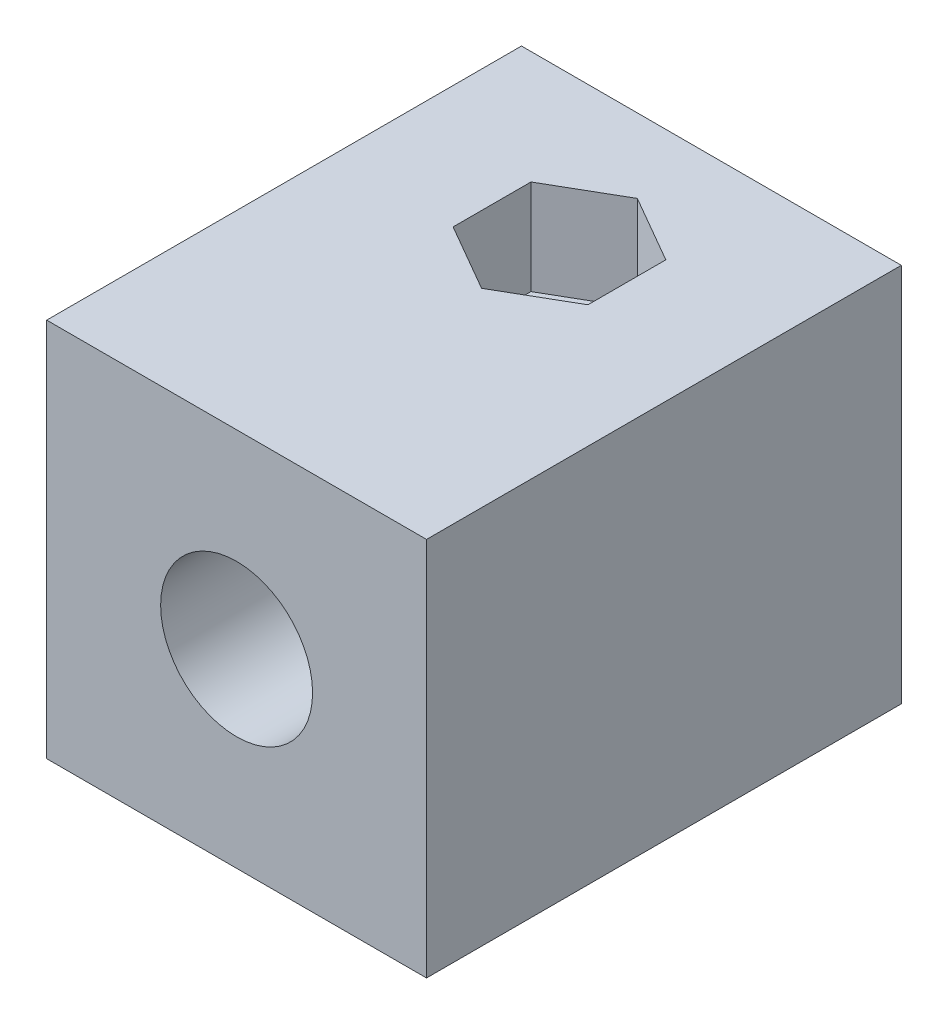
ISO-10303-21;
HEADER;
FILE_DESCRIPTION(('STEP AP214'),'2;1');
FILE_NAME('part.step','',(''),(''),'','','');
FILE_SCHEMA(('AUTOMOTIVE_DESIGN { 1 0 10303 214 1 1 1 1 }'));
ENDSEC;
DATA;
#1=APPLICATION_CONTEXT('core data for automotive mechanical design processes');
#2=APPLICATION_PROTOCOL_DEFINITION('international standard','automotive_design',2000,#1);
#3=PRODUCT_CONTEXT('',#1,'mechanical');
#4=PRODUCT('Part','Part','',(#3));
#5=PRODUCT_RELATED_PRODUCT_CATEGORY('part','',(#4));
#6=PRODUCT_DEFINITION_FORMATION('','',#4);
#7=PRODUCT_DEFINITION_CONTEXT('part definition',#1,'design');
#8=PRODUCT_DEFINITION('design','',#6,#7);
#9=PRODUCT_DEFINITION_SHAPE('','',#8);
#10=(LENGTH_UNIT() NAMED_UNIT(*) SI_UNIT(.MILLI.,.METRE.));
#11=(NAMED_UNIT(*) PLANE_ANGLE_UNIT() SI_UNIT($,.RADIAN.));
#12=(NAMED_UNIT(*) SI_UNIT($,.STERADIAN.) SOLID_ANGLE_UNIT());
#13=UNCERTAINTY_MEASURE_WITH_UNIT(LENGTH_MEASURE(1.E-05),#10,'distance_accuracy_value','');
#14=(GEOMETRIC_REPRESENTATION_CONTEXT(3) GLOBAL_UNCERTAINTY_ASSIGNED_CONTEXT((#13)) GLOBAL_UNIT_ASSIGNED_CONTEXT((#10,
#11,#12)) REPRESENTATION_CONTEXT('',''));
#15=CARTESIAN_POINT('',(0.,0.,0.));
#16=DIRECTION('',(0.,0.,1.));
#17=DIRECTION('',(1.,0.,0.));
#18=AXIS2_PLACEMENT_3D('',#15,#16,#17);
#19=CARTESIAN_POINT('',(0.,0.,-4.5));
#20=DIRECTION('',(0.,1.,0.));
#21=DIRECTION('',(0.,0.,1.));
#22=AXIS2_PLACEMENT_3D('',#19,#20,#21);
#23=CYLINDRICAL_SURFACE('',#22,1.5);
#24=CARTESIAN_POINT('',(0.,14.,-3.));
#25=CARTESIAN_POINT('',(0.0812350589378528,14.0000021745615,-2.99999709769689));
#26=CARTESIAN_POINT('',(0.162450241781792,13.9975037928318,-3.00661976024838));
#27=CARTESIAN_POINT('',(0.322453452352361,13.9877869600693,-3.03282819526993));
#28=CARTESIAN_POINT('',(0.401241827987616,13.9805691889399,-3.05241210047057));
#29=CARTESIAN_POINT('',(0.554060784990879,13.9621883239154,-3.10375300177176));
#30=CARTESIAN_POINT('',(0.628100224162277,13.9510328434944,-3.13548651682179));
#31=CARTESIAN_POINT('',(0.769799310160253,13.9258876776535,-3.21010641301582));
#32=CARTESIAN_POINT('',(0.837457239177879,13.9118972322755,-3.25299578554416));
#33=CARTESIAN_POINT('',(0.967346417045826,13.8818624697122,-3.35061253107091));
#34=CARTESIAN_POINT('',(1.02927073015119,13.8657600258357,-3.4057302622594));
#35=CARTESIAN_POINT('',(1.14324421474363,13.8336022087133,-3.52541043465884));
#36=CARTESIAN_POINT('',(1.19529036359203,13.8175468513503,-3.58997575608788));
#37=CARTESIAN_POINT('',(1.28998202215985,13.7866247061773,-3.72971746752321));
#38=CARTESIAN_POINT('',(1.3321939319576,13.7718264882082,-3.80520436654582));
#39=CARTESIAN_POINT('',(1.40318646334084,13.7459986023743,-3.96284835416852));
#40=CARTESIAN_POINT('',(1.43197244961239,13.7349674297588,-4.0450027631551));
#41=CARTESIAN_POINT('',(1.47408431017549,13.7185441282414,-4.2101167402582));
#42=CARTESIAN_POINT('',(1.48799593218558,13.7129392435084,-4.29290503843544));
#43=CARTESIAN_POINT('',(1.50179556531648,13.7073806146121,-4.45981615799384));
#44=CARTESIAN_POINT('',(1.5016893680263,13.707424536593,-4.54393841387447));
#45=CARTESIAN_POINT('',(1.48790429610018,13.7129751163205,-4.70576952521296));
#46=CARTESIAN_POINT('',(1.47503808509003,13.7181546887112,-4.78356090604418));
#47=CARTESIAN_POINT('',(1.4374416786833,13.7328493805953,-4.93578715040532));
#48=CARTESIAN_POINT('',(1.41270969663258,13.7423651529886,-5.01022150661388));
#49=CARTESIAN_POINT('',(1.35163748571904,13.7648570219025,-5.15527706772823));
#50=CARTESIAN_POINT('',(1.31508648737101,13.7778951798817,-5.2257994861213));
#51=CARTESIAN_POINT('',(1.23156073762698,13.8059421013932,-5.35994573759097));
#52=CARTESIAN_POINT('',(1.18458238728897,13.8209515445716,-5.4235671775197));
#53=CARTESIAN_POINT('',(1.07781780766549,13.8524803885911,-5.54660366365088));
#54=CARTESIAN_POINT('',(1.01738298716955,13.8690334745567,-5.60544864074809));
#55=CARTESIAN_POINT('',(0.88731259081902,13.9009172816409,-5.7123379662058));
#56=CARTESIAN_POINT('',(0.817675603497363,13.9162478146595,-5.76038065460567));
#57=CARTESIAN_POINT('',(0.669723436992419,13.9442639480908,-5.84493039706252));
#58=CARTESIAN_POINT('',(0.591290713844718,13.9569049825962,-5.88124758122106));
#59=CARTESIAN_POINT('',(0.428836850524582,13.9777871832696,-5.93998260427004));
#60=CARTESIAN_POINT('',(0.344818210845767,13.9860303034149,-5.96240661656112));
#61=CARTESIAN_POINT('',(0.178375243148664,13.9968444322807,-5.99162278754194));
#62=CARTESIAN_POINT('',(0.0961036195622086,13.9996936902569,-5.99918260638251));
#63=CARTESIAN_POINT('',(-0.0685724752550247,14.0002589370013,-6.00069106389992));
#64=CARTESIAN_POINT('',(-0.150976912983373,13.9979760638686,-5.99464272031678));
#65=CARTESIAN_POINT('',(-0.310262048561859,13.9887170977264,-5.96968995769133));
#66=CARTESIAN_POINT('',(-0.387233328007336,13.981924709623,-5.95128845626292));
#67=CARTESIAN_POINT('',(-0.536941754957221,13.9645147709172,-5.90281392745268));
#68=CARTESIAN_POINT('',(-0.609678350347535,13.9538967228203,-5.87273938205196));
#69=CARTESIAN_POINT('',(-0.751247765110156,13.9294962440768,-5.80081358756052));
#70=CARTESIAN_POINT('',(-0.819903083557796,13.9156300020935,-5.75864227077661));
#71=CARTESIAN_POINT('',(-0.949392711726626,13.8862667156466,-5.66408189682844));
#72=CARTESIAN_POINT('',(-1.01022412027045,13.8707690700952,-5.61168906745485));
#73=CARTESIAN_POINT('',(-1.12603079874454,13.8387332949099,-5.49459587787573));
#74=CARTESIAN_POINT('',(-1.18046154123568,13.8221869650373,-5.4293578172273));
#75=CARTESIAN_POINT('',(-1.27771050031903,13.7907881574685,-5.29034861529234));
#76=CARTESIAN_POINT('',(-1.32052767414518,13.775935831944,-5.2165767086115));
#77=CARTESIAN_POINT('',(-1.39337773518998,13.7496682982246,-5.06198401322769));
#78=CARTESIAN_POINT('',(-1.42335685446918,13.7382676032849,-4.98113525408956));
#79=CARTESIAN_POINT('',(-1.46907883466889,13.7205403289101,-4.81499023631218));
#80=CARTESIAN_POINT('',(-1.48483050305535,13.7142106105749,-4.72969676380188));
#81=CARTESIAN_POINT('',(-1.50086347097839,13.7077589479257,-4.56298384045889));
#82=CARTESIAN_POINT('',(-1.50207331495837,13.7072644452334,-4.48166736828312));
#83=CARTESIAN_POINT('',(-1.49136715641593,13.7115841274529,-4.32005468372384));
#84=CARTESIAN_POINT('',(-1.47945239850124,13.716397808989,-4.23975837532842));
#85=CARTESIAN_POINT('',(-1.44355815630242,13.7304814158543,-4.08495277328345));
#86=CARTESIAN_POINT('',(-1.41995798316524,13.7396108537666,-4.01034165375466));
#87=CARTESIAN_POINT('',(-1.3616969677992,13.7612154829784,-3.86609449150558));
#88=CARTESIAN_POINT('',(-1.32703332944945,13.7736915199521,-3.79645971192986));
#89=CARTESIAN_POINT('',(-1.24552075938154,13.8013972390396,-3.66017321030237));
#90=CARTESIAN_POINT('',(-1.1981283280301,13.8167369844096,-3.59386920320009));
#91=CARTESIAN_POINT('',(-1.09334485729906,13.8480624675718,-3.4698584390288));
#92=CARTESIAN_POINT('',(-1.03595064012808,13.8640484094314,-3.41215442521325));
#93=CARTESIAN_POINT('',(-0.909080396784623,13.8959042460988,-3.30379804417816));
#94=CARTESIAN_POINT('',(-0.839118644212992,13.9117210490064,-3.25369624656533));
#95=CARTESIAN_POINT('',(-0.691213223200821,13.9405451445703,-3.16597734472344));
#96=CARTESIAN_POINT('',(-0.613268934090621,13.9535522185156,-3.12836121226363));
#97=CARTESIAN_POINT('',(-0.447999082002312,13.9757429260668,-3.06562317095167));
#98=CARTESIAN_POINT('',(-0.360413422234208,13.9847365715836,-3.0411129353981));
#99=CARTESIAN_POINT('',(-0.181875733606382,13.9968624217959,-3.00830704007932));
#100=CARTESIAN_POINT('',(-0.0909254163648589,13.9999975660397,-3.00000324851268));
#101=CARTESIAN_POINT('',(0.,14.,-3.));
#102=B_SPLINE_CURVE_WITH_KNOTS('',3,(#24,#25,#26,#27,#28,#29,#30,#31,#32,#33,#34,#35,#36,#37,
#38,#39,#40,#41,#42,#43,#44,#45,#46,#47,#48,#49,#50,#51,#52,#53,#54,#55,#56,#57,#58,#59,#60,#61,
#62,#63,#64,#65,#66,#67,#68,#69,#70,#71,#72,#73,#74,#75,#76,#77,#78,#79,#80,#81,#82,#83,#84,#85,
#86,#87,#88,#89,#90,#91,#92,#93,#94,#95,#96,#97,#98,#99,#100,#101),.UNSPECIFIED.,.T.,.F.,(4,2,2,
2,2,2,2,2,2,2,2,2,2,2,2,2,2,2,2,2,2,2,2,2,2,2,2,2,2,2,2,2,2,2,2,2,2,2,4),(0.,0.24336980156056,
0.486704549530461,0.729571369213573,0.97250337960949,1.22473618582715,1.47704604925622,
1.73896674501659,2.00078269352134,2.25185874416902,2.50283106079707,2.73878345119971,
2.97477138060589,3.21522408387018,3.45575990744259,3.71246153335813,3.96920257905066,
4.22991375286075,4.49050899698846,4.73725019635926,4.98393668390521,5.2211443792384,
5.45838293254454,5.702592218596,5.94689180019868,6.20536519455658,6.46386178920141,
6.72343066727204,6.98283874956507,7.22558763480252,7.46831350211259,7.70363142426533,
7.93900886656507,8.18672471884271,8.43451941997062,8.69572329654039,8.95694749805102,
9.22948515032042,9.50188601796128),.UNSPECIFIED.);
#103=CARTESIAN_POINT('',(0.,14.,-3.));
#104=VERTEX_POINT('',#103);
#105=EDGE_CURVE('E181',#104,#104,#102,.T.);
#106=ORIENTED_EDGE('',*,*,#105,.F.);
#107=EDGE_LOOP('',(#106));
#108=FACE_BOUND('',#107,.T.);
#109=CARTESIAN_POINT('',(0.,15.,-4.5));
#110=DIRECTION('',(0.,1.,0.));
#111=DIRECTION('',(0.,0.,1.));
#112=AXIS2_PLACEMENT_3D('',#109,#110,#111);
#113=CIRCLE('',#112,1.5);
#114=CARTESIAN_POINT('',(0.,15.,-3.));
#115=VERTEX_POINT('',#114);
#116=EDGE_CURVE('E39',#115,#115,#113,.F.);
#117=ORIENTED_EDGE('',*,*,#116,.F.);
#118=EDGE_LOOP('',(#117));
#119=FACE_BOUND('',#118,.T.);
#120=ADVANCED_FACE('F35',(#108,#119),#23,.F.);
#121=CARTESIAN_POINT('',(-10.,20.,12.5));
#122=DIRECTION('',(1.,0.,0.));
#123=DIRECTION('',(0.,0.,-1.));
#124=AXIS2_PLACEMENT_3D('',#121,#122,#123);
#125=PLANE('',#124);
#126=DIRECTION('',(0.,0.,1.));
#127=VECTOR('',#126,1.);
#128=CARTESIAN_POINT('',(-10.,0.,12.5));
#129=LINE('',#128,#127);
#130=CARTESIAN_POINT('',(-10.,0.,-12.5));
#131=VERTEX_POINT('',#130);
#132=CARTESIAN_POINT('',(-10.,0.,12.5));
#133=VERTEX_POINT('',#132);
#134=EDGE_CURVE('E185',#131,#133,#129,.T.);
#135=ORIENTED_EDGE('',*,*,#134,.T.);
#136=DIRECTION('',(0.,-1.,0.));
#137=VECTOR('',#136,1.);
#138=CARTESIAN_POINT('',(-10.,20.,12.5));
#139=LINE('',#138,#137);
#140=CARTESIAN_POINT('',(-10.,20.,12.5));
#141=VERTEX_POINT('',#140);
#142=EDGE_CURVE('E11',#141,#133,#139,.T.);
#143=ORIENTED_EDGE('',*,*,#142,.F.);
#144=DIRECTION('',(0.,0.,1.));
#145=VECTOR('',#144,1.);
#146=CARTESIAN_POINT('',(-10.,20.,12.5));
#147=LINE('',#146,#145);
#148=CARTESIAN_POINT('',(-10.,20.,-12.5));
#149=VERTEX_POINT('',#148);
#150=EDGE_CURVE('E190',#149,#141,#147,.T.);
#151=ORIENTED_EDGE('',*,*,#150,.F.);
#152=DIRECTION('',(0.,-1.,0.));
#153=VECTOR('',#152,1.);
#154=CARTESIAN_POINT('',(-10.,20.,-12.5));
#155=LINE('',#154,#153);
#156=EDGE_CURVE('E196',#149,#131,#155,.T.);
#157=ORIENTED_EDGE('',*,*,#156,.T.);
#158=EDGE_LOOP('',(#135,#143,#151,#157));
#159=FACE_BOUND('',#158,.T.);
#160=ADVANCED_FACE('F37',(#159),#125,.F.);
#161=CARTESIAN_POINT('',(10.,20.,12.5));
#162=DIRECTION('',(0.,0.,-1.));
#163=DIRECTION('',(-1.,0.,0.));
#164=AXIS2_PLACEMENT_3D('',#161,#162,#163);
#165=PLANE('',#164);
#166=CARTESIAN_POINT('',(0.,10.,12.5));
#167=DIRECTION('',(0.,0.,1.));
#168=DIRECTION('',(1.,0.,0.));
#169=AXIS2_PLACEMENT_3D('',#166,#167,#168);
#170=CIRCLE('',#169,4.);
#171=CARTESIAN_POINT('',(4.,10.,12.5));
#172=VERTEX_POINT('',#171);
#173=EDGE_CURVE('E186',#172,#172,#170,.T.);
#174=ORIENTED_EDGE('',*,*,#173,.F.);
#175=EDGE_LOOP('',(#174));
#176=FACE_BOUND('',#175,.T.);
#177=DIRECTION('',(1.,0.,0.));
#178=VECTOR('',#177,1.);
#179=CARTESIAN_POINT('',(10.,0.,12.5));
#180=LINE('',#179,#178);
#181=CARTESIAN_POINT('',(10.,0.,12.5));
#182=VERTEX_POINT('',#181);
#183=EDGE_CURVE('E199',#133,#182,#180,.T.);
#184=ORIENTED_EDGE('',*,*,#183,.T.);
#185=DIRECTION('',(0.,-1.,0.));
#186=VECTOR('',#185,1.);
#187=CARTESIAN_POINT('',(10.,20.,12.5));
#188=LINE('',#187,#186);
#189=CARTESIAN_POINT('',(10.,20.,12.5));
#190=VERTEX_POINT('',#189);
#191=EDGE_CURVE('E44',#190,#182,#188,.T.);
#192=ORIENTED_EDGE('',*,*,#191,.F.);
#193=DIRECTION('',(1.,0.,0.));
#194=VECTOR('',#193,1.);
#195=CARTESIAN_POINT('',(10.,20.,12.5));
#196=LINE('',#195,#194);
#197=EDGE_CURVE('E89',#141,#190,#196,.T.);
#198=ORIENTED_EDGE('',*,*,#197,.F.);
#199=ORIENTED_EDGE('',*,*,#142,.T.);
#200=EDGE_LOOP('',(#184,#192,#198,#199));
#201=FACE_BOUND('',#200,.T.);
#202=ADVANCED_FACE('F242',(#176,#201),#165,.F.);
#203=CARTESIAN_POINT('',(10.,20.,12.5));
#204=DIRECTION('',(-1.,0.,0.));
#205=DIRECTION('',(0.,0.,1.));
#206=AXIS2_PLACEMENT_3D('',#203,#204,#205);
#207=PLANE('',#206);
#208=DIRECTION('',(0.,0.,-1.));
#209=VECTOR('',#208,1.);
#210=CARTESIAN_POINT('',(10.,0.,12.5));
#211=LINE('',#210,#209);
#212=CARTESIAN_POINT('',(10.,0.,-12.5));
#213=VERTEX_POINT('',#212);
#214=EDGE_CURVE('E201',#182,#213,#211,.T.);
#215=ORIENTED_EDGE('',*,*,#214,.T.);
#216=DIRECTION('',(0.,-1.,0.));
#217=VECTOR('',#216,1.);
#218=CARTESIAN_POINT('',(10.,20.,-12.5));
#219=LINE('',#218,#217);
#220=CARTESIAN_POINT('',(10.,20.,-12.5));
#221=VERTEX_POINT('',#220);
#222=EDGE_CURVE('E205',#221,#213,#219,.T.);
#223=ORIENTED_EDGE('',*,*,#222,.F.);
#224=DIRECTION('',(0.,0.,-1.));
#225=VECTOR('',#224,1.);
#226=CARTESIAN_POINT('',(10.,20.,12.5));
#227=LINE('',#226,#225);
#228=EDGE_CURVE('E193',#190,#221,#227,.T.);
#229=ORIENTED_EDGE('',*,*,#228,.F.);
#230=ORIENTED_EDGE('',*,*,#191,.T.);
#231=EDGE_LOOP('',(#215,#223,#229,#230));
#232=FACE_BOUND('',#231,.T.);
#233=ADVANCED_FACE('F344',(#232),#207,.F.);
#234=CARTESIAN_POINT('',(10.,20.,-12.5));
#235=DIRECTION('',(0.,0.,1.));
#236=DIRECTION('',(1.,0.,0.));
#237=AXIS2_PLACEMENT_3D('',#234,#235,#236);
#238=PLANE('',#237);
#239=DIRECTION('',(-1.,0.,0.));
#240=VECTOR('',#239,1.);
#241=CARTESIAN_POINT('',(10.,0.,-12.5));
#242=LINE('',#241,#240);
#243=EDGE_CURVE('E82',#213,#131,#242,.T.);
#244=ORIENTED_EDGE('',*,*,#243,.T.);
#245=ORIENTED_EDGE('',*,*,#156,.F.);
#246=DIRECTION('',(-1.,0.,0.));
#247=VECTOR('',#246,1.);
#248=CARTESIAN_POINT('',(10.,20.,-12.5));
#249=LINE('',#248,#247);
#250=EDGE_CURVE('E61',#221,#149,#249,.T.);
#251=ORIENTED_EDGE('',*,*,#250,.F.);
#252=ORIENTED_EDGE('',*,*,#222,.T.);
#253=EDGE_LOOP('',(#244,#245,#251,#252));
#254=FACE_BOUND('',#253,.T.);
#255=ADVANCED_FACE('F304',(#254),#238,.F.);
#256=CARTESIAN_POINT('',(0.,20.,0.));
#257=DIRECTION('',(0.,1.,0.));
#258=DIRECTION('',(0.,0.,1.));
#259=AXIS2_PLACEMENT_3D('',#256,#257,#258);
#260=PLANE('',#259);
#261=DIRECTION('',(-0.866025403784438,0.,-0.5));
#262=VECTOR('',#261,1.);
#263=CARTESIAN_POINT('',(3.5507041555162,20.,-6.55));
#264=LINE('',#263,#262);
#265=CARTESIAN_POINT('',(3.5507041555162,20.,-6.55));
#266=VERTEX_POINT('',#265);
#267=CARTESIAN_POINT('',(0.,20.,-8.6));
#268=VERTEX_POINT('',#267);
#269=EDGE_CURVE('E52',#266,#268,#264,.T.);
#270=ORIENTED_EDGE('',*,*,#269,.F.);
#271=DIRECTION('',(0.,0.,-1.));
#272=VECTOR('',#271,1.);
#273=CARTESIAN_POINT('',(3.55070415551621,20.,-2.45));
#274=LINE('',#273,#272);
#275=CARTESIAN_POINT('',(3.55070415551621,20.,-2.45));
#276=VERTEX_POINT('',#275);
#277=EDGE_CURVE('E145',#276,#266,#274,.T.);
#278=ORIENTED_EDGE('',*,*,#277,.F.);
#279=DIRECTION('',(0.866025403784439,0.,-0.5));
#280=VECTOR('',#279,1.);
#281=CARTESIAN_POINT('',(0.,20.,-0.399999999999992));
#282=LINE('',#281,#280);
#283=CARTESIAN_POINT('',(0.,20.,-0.399999999999992));
#284=VERTEX_POINT('',#283);
#285=EDGE_CURVE('E148',#284,#276,#282,.T.);
#286=ORIENTED_EDGE('',*,*,#285,.F.);
#287=DIRECTION('',(0.866025403784439,0.,0.5));
#288=VECTOR('',#287,1.);
#289=CARTESIAN_POINT('',(-3.55070415551621,20.,-2.45));
#290=LINE('',#289,#288);
#291=CARTESIAN_POINT('',(-3.55070415551621,20.,-2.45));
#292=VERTEX_POINT('',#291);
#293=EDGE_CURVE('E164',#292,#284,#290,.T.);
#294=ORIENTED_EDGE('',*,*,#293,.F.);
#295=DIRECTION('',(0.,0.,1.));
#296=VECTOR('',#295,1.);
#297=CARTESIAN_POINT('',(-3.55070415551621,20.,-6.55000000000001));
#298=LINE('',#297,#296);
#299=CARTESIAN_POINT('',(-3.55070415551621,20.,-6.55000000000001));
#300=VERTEX_POINT('',#299);
#301=EDGE_CURVE('E161',#300,#292,#298,.T.);
#302=ORIENTED_EDGE('',*,*,#301,.F.);
#303=DIRECTION('',(-0.86602540378444,0.,0.499999999999998));
#304=VECTOR('',#303,1.);
#305=CARTESIAN_POINT('',(0.,20.,-8.6));
#306=LINE('',#305,#304);
#307=EDGE_CURVE('E159',#268,#300,#306,.T.);
#308=ORIENTED_EDGE('',*,*,#307,.F.);
#309=EDGE_LOOP('',(#270,#278,#286,#294,#302,#308));
#310=FACE_BOUND('',#309,.T.);
#311=ORIENTED_EDGE('',*,*,#150,.T.);
#312=ORIENTED_EDGE('',*,*,#197,.T.);
#313=ORIENTED_EDGE('',*,*,#228,.T.);
#314=ORIENTED_EDGE('',*,*,#250,.T.);
#315=EDGE_LOOP('',(#311,#312,#313,#314));
#316=FACE_BOUND('',#315,.T.);
#317=ADVANCED_FACE('F301',(#310,#316),#260,.T.);
#318=CARTESIAN_POINT('',(0.,0.,0.));
#319=DIRECTION('',(0.,1.,0.));
#320=DIRECTION('',(0.,0.,1.));
#321=AXIS2_PLACEMENT_3D('',#318,#319,#320);
#322=PLANE('',#321);
#323=CARTESIAN_POINT('',(0.,0.,-4.5));
#324=DIRECTION('',(0.,1.,0.));
#325=DIRECTION('',(0.,0.,1.));
#326=AXIS2_PLACEMENT_3D('',#323,#324,#325);
#327=CIRCLE('',#326,1.5);
#328=CARTESIAN_POINT('',(0.,0.,-3.));
#329=VERTEX_POINT('',#328);
#330=EDGE_CURVE('E178',#329,#329,#327,.T.);
#331=ORIENTED_EDGE('',*,*,#330,.T.);
#332=EDGE_LOOP('',(#331));
#333=FACE_BOUND('',#332,.T.);
#334=ORIENTED_EDGE('',*,*,#134,.F.);
#335=ORIENTED_EDGE('',*,*,#243,.F.);
#336=ORIENTED_EDGE('',*,*,#214,.F.);
#337=ORIENTED_EDGE('',*,*,#183,.F.);
#338=EDGE_LOOP('',(#334,#335,#336,#337));
#339=FACE_BOUND('',#338,.T.);
#340=ADVANCED_FACE('F233',(#333,#339),#322,.F.);
#341=CARTESIAN_POINT('',(0.,10.,-7.5));
#342=DIRECTION('',(0.,0.,1.));
#343=DIRECTION('',(1.,0.,0.));
#344=AXIS2_PLACEMENT_3D('',#341,#342,#343);
#345=CYLINDRICAL_SURFACE('',#344,4.);
#346=CARTESIAN_POINT('',(0.,6.,-3.));
#347=CARTESIAN_POINT('',(-0.0812350589378528,5.99999782543849,-2.99999709769689));
#348=CARTESIAN_POINT('',(-0.162450241781792,6.00249620716816,-3.00661976024838));
#349=CARTESIAN_POINT('',(-0.322453452352361,6.01221303993072,-3.03282819526993));
#350=CARTESIAN_POINT('',(-0.401241827987616,6.01943081106007,-3.05241210047057));
#351=CARTESIAN_POINT('',(-0.554060784990879,6.03781167608455,-3.10375300177176));
#352=CARTESIAN_POINT('',(-0.628100224162277,6.0489671565056,-3.13548651682179));
#353=CARTESIAN_POINT('',(-0.769799310160254,6.07411232234647,-3.21010641301582));
#354=CARTESIAN_POINT('',(-0.837457239177879,6.08810276772452,-3.25299578554416));
#355=CARTESIAN_POINT('',(-0.967346417045825,6.11813753028783,-3.35061253107091));
#356=CARTESIAN_POINT('',(-1.02927073015119,6.13423997416434,-3.4057302622594));
#357=CARTESIAN_POINT('',(-1.14324421474363,6.16639779128673,-3.52541043465884));
#358=CARTESIAN_POINT('',(-1.19529036359203,6.18245314864967,-3.58997575608787));
#359=CARTESIAN_POINT('',(-1.28998202215985,6.21337529382269,-3.72971746752321));
#360=CARTESIAN_POINT('',(-1.3321939319576,6.22817351179182,-3.80520436654582));
#361=CARTESIAN_POINT('',(-1.40318646334084,6.25400139762567,-3.96284835416852));
#362=CARTESIAN_POINT('',(-1.43197244961239,6.26503257024119,-4.0450027631551));
#363=CARTESIAN_POINT('',(-1.47408431017549,6.28145587175864,-4.2101167402582));
#364=CARTESIAN_POINT('',(-1.48799593218558,6.28706075649162,-4.29290503843544));
#365=CARTESIAN_POINT('',(-1.50179556531648,6.29261938538785,-4.45981615799384));
#366=CARTESIAN_POINT('',(-1.50168936802631,6.29257546340695,-4.54393841387447));
#367=CARTESIAN_POINT('',(-1.48790429610018,6.28702488367945,-4.70576952521296));
#368=CARTESIAN_POINT('',(-1.47503808509003,6.28184531128878,-4.78356090604418));
#369=CARTESIAN_POINT('',(-1.4374416786833,6.26715061940471,-4.93578715040532));
#370=CARTESIAN_POINT('',(-1.41270969663258,6.25763484701137,-5.01022150661388));
#371=CARTESIAN_POINT('',(-1.35163748571904,6.23514297809747,-5.15527706772823));
#372=CARTESIAN_POINT('',(-1.31508648737101,6.22210482011834,-5.2257994861213));
#373=CARTESIAN_POINT('',(-1.23156073762698,6.19405789860681,-5.35994573759097));
#374=CARTESIAN_POINT('',(-1.18458238728897,6.17904845542842,-5.4235671775197));
#375=CARTESIAN_POINT('',(-1.07781780766549,6.14751961140887,-5.54660366365088));
#376=CARTESIAN_POINT('',(-1.01738298716955,6.13096652544329,-5.60544864074809));
#377=CARTESIAN_POINT('',(-0.887312590819021,6.09908271835915,-5.7123379662058));
#378=CARTESIAN_POINT('',(-0.817675603497364,6.08375218534048,-5.76038065460567));
#379=CARTESIAN_POINT('',(-0.66972343699242,6.0557360519092,-5.84493039706252));
#380=CARTESIAN_POINT('',(-0.591290713844719,6.04309501740384,-5.88124758122106));
#381=CARTESIAN_POINT('',(-0.428836850524584,6.02221281673038,-5.93998260427004));
#382=CARTESIAN_POINT('',(-0.344818210845768,6.01396969658507,-5.96240661656112));
#383=CARTESIAN_POINT('',(-0.178375243148666,6.00315556771935,-5.99162278754194));
#384=CARTESIAN_POINT('',(-0.0961036195622097,6.00030630974314,-5.99918260638251));
#385=CARTESIAN_POINT('',(0.0685724752550239,5.99974106299874,-6.00069106389992));
#386=CARTESIAN_POINT('',(0.150976912983373,6.00202393613137,-5.99464272031678));
#387=CARTESIAN_POINT('',(0.310262048561859,6.01128290227357,-5.96968995769133));
#388=CARTESIAN_POINT('',(0.387233328007335,6.01807529037695,-5.95128845626292));
#389=CARTESIAN_POINT('',(0.53694175495722,6.03548522908283,-5.90281392745268));
#390=CARTESIAN_POINT('',(0.609678350347534,6.0461032771797,-5.87273938205197));
#391=CARTESIAN_POINT('',(0.751247765110155,6.07050375592319,-5.80081358756053));
#392=CARTESIAN_POINT('',(0.819903083557795,6.08436999790652,-5.75864227077662));
#393=CARTESIAN_POINT('',(0.949392711726625,6.11373328435336,-5.66408189682844));
#394=CARTESIAN_POINT('',(1.01022412027045,6.12923092990484,-5.61168906745485));
#395=CARTESIAN_POINT('',(1.12603079874454,6.16126670509011,-5.49459587787573));
#396=CARTESIAN_POINT('',(1.18046154123568,6.17781303496271,-5.4293578172273));
#397=CARTESIAN_POINT('',(1.27771050031903,6.20921184253146,-5.29034861529234));
#398=CARTESIAN_POINT('',(1.32052767414518,6.22406416805601,-5.2165767086115));
#399=CARTESIAN_POINT('',(1.39337773518998,6.25033170177537,-5.06198401322769));
#400=CARTESIAN_POINT('',(1.42335685446918,6.26173239671507,-4.98113525408956));
#401=CARTESIAN_POINT('',(1.46907883466889,6.27945967108995,-4.81499023631218));
#402=CARTESIAN_POINT('',(1.48483050305535,6.28578938942509,-4.72969676380188));
#403=CARTESIAN_POINT('',(1.50086347097839,6.29224105207427,-4.56298384045889));
#404=CARTESIAN_POINT('',(1.50207331495837,6.29273555476659,-4.48166736828312));
#405=CARTESIAN_POINT('',(1.49136715641593,6.28841587254708,-4.32005468372384));
#406=CARTESIAN_POINT('',(1.47945239850124,6.28360219101101,-4.23975837532842));
#407=CARTESIAN_POINT('',(1.44355815630242,6.26951858414568,-4.08495277328345));
#408=CARTESIAN_POINT('',(1.41995798316524,6.26038914623337,-4.01034165375466));
#409=CARTESIAN_POINT('',(1.3616969677992,6.23878451702155,-3.86609449150558));
#410=CARTESIAN_POINT('',(1.32703332944945,6.22630848004785,-3.79645971192986));
#411=CARTESIAN_POINT('',(1.24552075938154,6.19860276096036,-3.66017321030237));
#412=CARTESIAN_POINT('',(1.1981283280301,6.18326301559036,-3.59386920320009));
#413=CARTESIAN_POINT('',(1.09334485729906,6.15193753242823,-3.4698584390288));
#414=CARTESIAN_POINT('',(1.03595064012808,6.13595159056855,-3.41215442521325));
#415=CARTESIAN_POINT('',(0.909080396784624,6.10409575390119,-3.30379804417816));
#416=CARTESIAN_POINT('',(0.839118644212993,6.08827895099355,-3.25369624656533));
#417=CARTESIAN_POINT('',(0.691213223200821,6.05945485542969,-3.16597734472344));
#418=CARTESIAN_POINT('',(0.613268934090622,6.04644778148441,-3.12836121226363));
#419=CARTESIAN_POINT('',(0.447999082002313,6.0242570739332,-3.06562317095167));
#420=CARTESIAN_POINT('',(0.360413422234209,6.01526342841644,-3.0411129353981));
#421=CARTESIAN_POINT('',(0.181875733606382,6.00313757820413,-3.00830704007932));
#422=CARTESIAN_POINT('',(0.0909254163648591,6.00000243396033,-3.00000324851268));
#423=CARTESIAN_POINT('',(0.,6.,-3.));
#424=B_SPLINE_CURVE_WITH_KNOTS('',3,(#346,#347,#348,#349,#350,#351,#352,#353,#354,#355,#356,
#357,#358,#359,#360,#361,#362,#363,#364,#365,#366,#367,#368,#369,#370,#371,#372,#373,#374,#375,
#376,#377,#378,#379,#380,#381,#382,#383,#384,#385,#386,#387,#388,#389,#390,#391,#392,#393,#394,
#395,#396,#397,#398,#399,#400,#401,#402,#403,#404,#405,#406,#407,#408,#409,#410,#411,#412,#413,
#414,#415,#416,#417,#418,#419,#420,#421,#422,#423),.UNSPECIFIED.,.T.,.F.,(4,2,2,2,2,2,2,2,2,2,2,
2,2,2,2,2,2,2,2,2,2,2,2,2,2,2,2,2,2,2,2,2,2,2,2,2,2,2,4),(0.,0.24336980156056,0.486704549530461,
0.729571369213573,0.97250337960949,1.22473618582715,1.47704604925622,1.73896674501659,
2.00078269352134,2.25185874416901,2.50283106079707,2.73878345119971,2.97477138060589,
3.21522408387018,3.45575990744258,3.71246153335813,3.96920257905066,4.22991375286075,
4.49050899698846,4.73725019635925,4.9839366839052,5.2211443792384,5.45838293254453,
5.702592218596,5.94689180019868,6.20536519455658,6.46386178920141,6.72343066727204,
6.98283874956507,7.22558763480252,7.46831350211259,7.70363142426533,7.93900886656506,
8.18672471884271,8.43451941997062,8.69572329654039,8.95694749805102,9.22948515032042,
9.50188601796127),.UNSPECIFIED.);
#425=CARTESIAN_POINT('',(0.,6.,-3.));
#426=VERTEX_POINT('',#425);
#427=EDGE_CURVE('E189',#426,#426,#424,.T.);
#428=ORIENTED_EDGE('',*,*,#427,.T.);
#429=EDGE_LOOP('',(#428));
#430=FACE_BOUND('',#429,.T.);
#431=ORIENTED_EDGE('',*,*,#105,.T.);
#432=EDGE_LOOP('',(#431));
#433=FACE_BOUND('',#432,.T.);
#434=CARTESIAN_POINT('',(0.,10.,-7.5));
#435=DIRECTION('',(0.,0.,1.));
#436=DIRECTION('',(1.,0.,0.));
#437=AXIS2_PLACEMENT_3D('',#434,#435,#436);
#438=CIRCLE('',#437,4.);
#439=CARTESIAN_POINT('',(4.,10.,-7.5));
#440=VERTEX_POINT('',#439);
#441=EDGE_CURVE('E182',#440,#440,#438,.T.);
#442=ORIENTED_EDGE('',*,*,#441,.F.);
#443=EDGE_LOOP('',(#442));
#444=FACE_BOUND('',#443,.T.);
#445=ORIENTED_EDGE('',*,*,#173,.T.);
#446=EDGE_LOOP('',(#445));
#447=FACE_BOUND('',#446,.T.);
#448=ADVANCED_FACE('F216',(#430,#433,#444,#447),#345,.F.);
#449=CARTESIAN_POINT('',(0.,10.,-7.5));
#450=DIRECTION('',(0.,0.,1.));
#451=DIRECTION('',(1.,0.,0.));
#452=AXIS2_PLACEMENT_3D('',#449,#450,#451);
#453=PLANE('',#452);
#454=ORIENTED_EDGE('',*,*,#441,.T.);
#455=EDGE_LOOP('',(#454));
#456=FACE_BOUND('',#455,.T.);
#457=ADVANCED_FACE('F224',(#456),#453,.T.);
#458=ORIENTED_EDGE('',*,*,#330,.F.);
#459=EDGE_LOOP('',(#458));
#460=FACE_BOUND('',#459,.T.);
#461=ORIENTED_EDGE('',*,*,#427,.F.);
#462=EDGE_LOOP('',(#461));
#463=FACE_BOUND('',#462,.T.);
#464=ADVANCED_FACE('F220',(#460,#463),#23,.F.);
#465=CARTESIAN_POINT('',(0.,15.,0.));
#466=DIRECTION('',(0.,1.,0.));
#467=DIRECTION('',(0.,0.,1.));
#468=AXIS2_PLACEMENT_3D('',#465,#466,#467);
#469=PLANE('',#468);
#470=DIRECTION('',(-0.866025403784438,0.,-0.5));
#471=VECTOR('',#470,1.);
#472=CARTESIAN_POINT('',(3.5507041555162,15.,-6.55));
#473=LINE('',#472,#471);
#474=CARTESIAN_POINT('',(3.5507041555162,15.,-6.55));
#475=VERTEX_POINT('',#474);
#476=CARTESIAN_POINT('',(0.,15.,-8.6));
#477=VERTEX_POINT('',#476);
#478=EDGE_CURVE('E125',#475,#477,#473,.T.);
#479=ORIENTED_EDGE('',*,*,#478,.T.);
#480=DIRECTION('',(-0.86602540378444,0.,0.499999999999998));
#481=VECTOR('',#480,1.);
#482=CARTESIAN_POINT('',(0.,15.,-8.6));
#483=LINE('',#482,#481);
#484=CARTESIAN_POINT('',(-3.55070415551621,15.,-6.55000000000001));
#485=VERTEX_POINT('',#484);
#486=EDGE_CURVE('E134',#477,#485,#483,.T.);
#487=ORIENTED_EDGE('',*,*,#486,.T.);
#488=DIRECTION('',(0.,0.,1.));
#489=VECTOR('',#488,1.);
#490=CARTESIAN_POINT('',(-3.55070415551621,15.,-6.55000000000001));
#491=LINE('',#490,#489);
#492=CARTESIAN_POINT('',(-3.55070415551621,15.,-2.45));
#493=VERTEX_POINT('',#492);
#494=EDGE_CURVE('E139',#485,#493,#491,.T.);
#495=ORIENTED_EDGE('',*,*,#494,.T.);
#496=DIRECTION('',(0.866025403784439,0.,0.5));
#497=VECTOR('',#496,1.);
#498=CARTESIAN_POINT('',(-3.55070415551621,15.,-2.45));
#499=LINE('',#498,#497);
#500=CARTESIAN_POINT('',(0.,15.,-0.399999999999992));
#501=VERTEX_POINT('',#500);
#502=EDGE_CURVE('E152',#493,#501,#499,.T.);
#503=ORIENTED_EDGE('',*,*,#502,.T.);
#504=DIRECTION('',(0.866025403784439,0.,-0.5));
#505=VECTOR('',#504,1.);
#506=CARTESIAN_POINT('',(0.,15.,-0.399999999999992));
#507=LINE('',#506,#505);
#508=CARTESIAN_POINT('',(3.55070415551621,15.,-2.45));
#509=VERTEX_POINT('',#508);
#510=EDGE_CURVE('E155',#501,#509,#507,.T.);
#511=ORIENTED_EDGE('',*,*,#510,.T.);
#512=DIRECTION('',(0.,0.,-1.));
#513=VECTOR('',#512,1.);
#514=CARTESIAN_POINT('',(3.55070415551621,15.,-2.45));
#515=LINE('',#514,#513);
#516=EDGE_CURVE('E131',#509,#475,#515,.T.);
#517=ORIENTED_EDGE('',*,*,#516,.T.);
#518=EDGE_LOOP('',(#479,#487,#495,#503,#511,#517));
#519=FACE_BOUND('',#518,.T.);
#520=ORIENTED_EDGE('',*,*,#116,.T.);
#521=EDGE_LOOP('',(#520));
#522=FACE_BOUND('',#521,.T.);
#523=ADVANCED_FACE('F141',(#519,#522),#469,.T.);
#524=CARTESIAN_POINT('',(3.5507041555162,15.,-6.55));
#525=DIRECTION('',(0.5,0.,-0.866025403784438));
#526=DIRECTION('',(-0.866025403784438,0.,-0.5));
#527=AXIS2_PLACEMENT_3D('',#524,#525,#526);
#528=PLANE('',#527);
#529=ORIENTED_EDGE('',*,*,#269,.T.);
#530=DIRECTION('',(0.,1.,0.));
#531=VECTOR('',#530,1.);
#532=CARTESIAN_POINT('',(0.,15.,-8.6));
#533=LINE('',#532,#531);
#534=EDGE_CURVE('E121',#477,#268,#533,.T.);
#535=ORIENTED_EDGE('',*,*,#534,.F.);
#536=ORIENTED_EDGE('',*,*,#478,.F.);
#537=DIRECTION('',(0.,1.,0.));
#538=VECTOR('',#537,1.);
#539=CARTESIAN_POINT('',(3.5507041555162,15.,-6.55));
#540=LINE('',#539,#538);
#541=EDGE_CURVE('E169',#475,#266,#540,.T.);
#542=ORIENTED_EDGE('',*,*,#541,.T.);
#543=EDGE_LOOP('',(#529,#535,#536,#542));
#544=FACE_BOUND('',#543,.T.);
#545=ADVANCED_FACE('F123',(#544),#528,.F.);
#546=CARTESIAN_POINT('',(3.55070415551621,15.,-2.45));
#547=DIRECTION('',(1.,0.,0.));
#548=DIRECTION('',(0.,0.,-1.));
#549=AXIS2_PLACEMENT_3D('',#546,#547,#548);
#550=PLANE('',#549);
#551=ORIENTED_EDGE('',*,*,#277,.T.);
#552=ORIENTED_EDGE('',*,*,#541,.F.);
#553=ORIENTED_EDGE('',*,*,#516,.F.);
#554=DIRECTION('',(0.,1.,0.));
#555=VECTOR('',#554,1.);
#556=CARTESIAN_POINT('',(3.55070415551621,15.,-2.45));
#557=LINE('',#556,#555);
#558=EDGE_CURVE('E171',#509,#276,#557,.T.);
#559=ORIENTED_EDGE('',*,*,#558,.T.);
#560=EDGE_LOOP('',(#551,#552,#553,#559));
#561=FACE_BOUND('',#560,.T.);
#562=ADVANCED_FACE('F254',(#561),#550,.F.);
#563=CARTESIAN_POINT('',(0.,15.,-0.399999999999992));
#564=DIRECTION('',(0.5,0.,0.866025403784439));
#565=DIRECTION('',(0.866025403784439,0.,-0.5));
#566=AXIS2_PLACEMENT_3D('',#563,#564,#565);
#567=PLANE('',#566);
#568=ORIENTED_EDGE('',*,*,#285,.T.);
#569=ORIENTED_EDGE('',*,*,#558,.F.);
#570=ORIENTED_EDGE('',*,*,#510,.F.);
#571=DIRECTION('',(0.,1.,0.));
#572=VECTOR('',#571,1.);
#573=CARTESIAN_POINT('',(0.,15.,-0.399999999999992));
#574=LINE('',#573,#572);
#575=EDGE_CURVE('E173',#501,#284,#574,.T.);
#576=ORIENTED_EDGE('',*,*,#575,.T.);
#577=EDGE_LOOP('',(#568,#569,#570,#576));
#578=FACE_BOUND('',#577,.T.);
#579=ADVANCED_FACE('F258',(#578),#567,.F.);
#580=CARTESIAN_POINT('',(-3.55070415551621,15.,-2.45));
#581=DIRECTION('',(-0.5,0.,0.866025403784439));
#582=DIRECTION('',(0.866025403784439,0.,0.5));
#583=AXIS2_PLACEMENT_3D('',#580,#581,#582);
#584=PLANE('',#583);
#585=ORIENTED_EDGE('',*,*,#293,.T.);
#586=ORIENTED_EDGE('',*,*,#575,.F.);
#587=ORIENTED_EDGE('',*,*,#502,.F.);
#588=DIRECTION('',(0.,1.,0.));
#589=VECTOR('',#588,1.);
#590=CARTESIAN_POINT('',(-3.55070415551621,15.,-2.45));
#591=LINE('',#590,#589);
#592=EDGE_CURVE('E175',#493,#292,#591,.T.);
#593=ORIENTED_EDGE('',*,*,#592,.T.);
#594=EDGE_LOOP('',(#585,#586,#587,#593));
#595=FACE_BOUND('',#594,.T.);
#596=ADVANCED_FACE('F262',(#595),#584,.F.);
#597=CARTESIAN_POINT('',(-3.55070415551621,15.,-6.55000000000001));
#598=DIRECTION('',(-1.,0.,0.));
#599=DIRECTION('',(0.,0.,1.));
#600=AXIS2_PLACEMENT_3D('',#597,#598,#599);
#601=PLANE('',#600);
#602=ORIENTED_EDGE('',*,*,#301,.T.);
#603=ORIENTED_EDGE('',*,*,#592,.F.);
#604=ORIENTED_EDGE('',*,*,#494,.F.);
#605=DIRECTION('',(0.,1.,0.));
#606=VECTOR('',#605,1.);
#607=CARTESIAN_POINT('',(-3.55070415551621,15.,-6.55000000000001));
#608=LINE('',#607,#606);
#609=EDGE_CURVE('E130',#485,#300,#608,.T.);
#610=ORIENTED_EDGE('',*,*,#609,.T.);
#611=EDGE_LOOP('',(#602,#603,#604,#610));
#612=FACE_BOUND('',#611,.T.);
#613=ADVANCED_FACE('F266',(#612),#601,.F.);
#614=CARTESIAN_POINT('',(0.,15.,-8.6));
#615=DIRECTION('',(-0.499999999999998,0.,-0.86602540378444));
#616=DIRECTION('',(-0.86602540378444,0.,0.499999999999998));
#617=AXIS2_PLACEMENT_3D('',#614,#615,#616);
#618=PLANE('',#617);
#619=ORIENTED_EDGE('',*,*,#307,.T.);
#620=ORIENTED_EDGE('',*,*,#609,.F.);
#621=ORIENTED_EDGE('',*,*,#486,.F.);
#622=ORIENTED_EDGE('',*,*,#534,.T.);
#623=EDGE_LOOP('',(#619,#620,#621,#622));
#624=FACE_BOUND('',#623,.T.);
#625=ADVANCED_FACE('F135',(#624),#618,.F.);
#626=CLOSED_SHELL('',(#120,#160,#202,#233,#255,#317,#340,#448,#457,#464,#523,#545,#562,#579,
#596,#613,#625));
#627=MANIFOLD_SOLID_BREP('B2',#626);
#628=ADVANCED_BREP_SHAPE_REPRESENTATION('',(#18,#627),#14);
#629=SHAPE_DEFINITION_REPRESENTATION(#9,#628);
ENDSEC;
END-ISO-10303-21;
